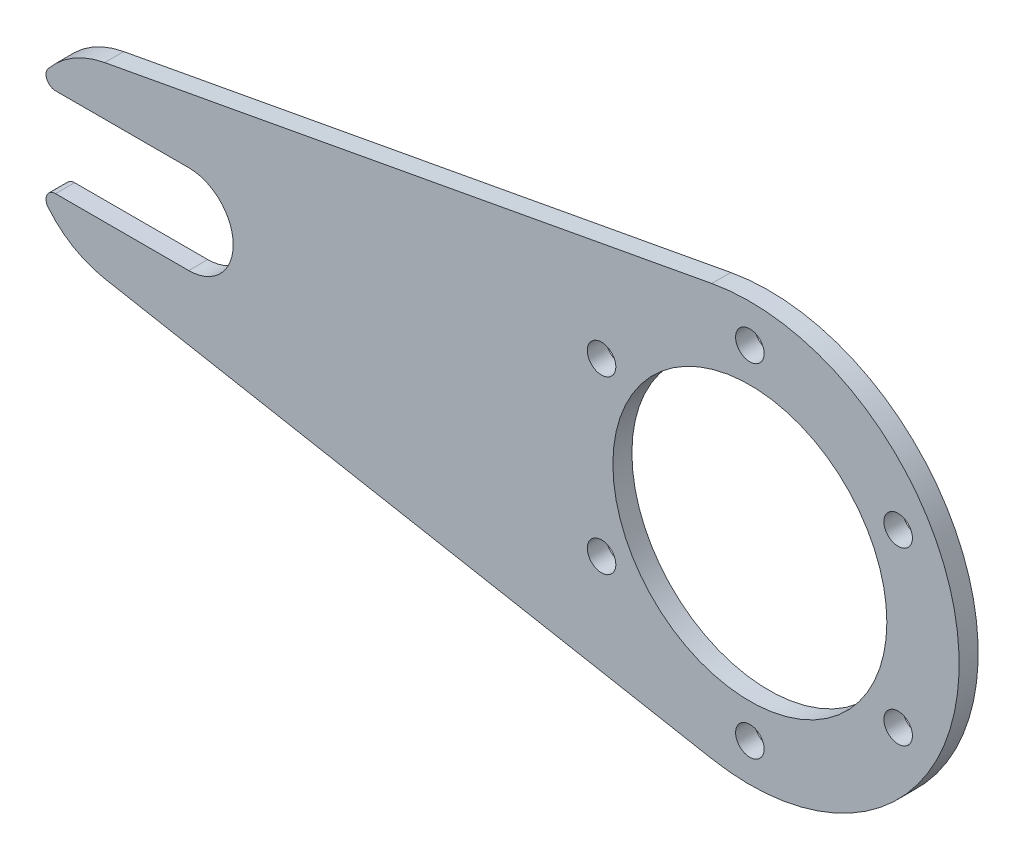
ISO-10303-21;
HEADER;
FILE_DESCRIPTION(('STEP AP214'),'2;1');
FILE_NAME('part.step','',(''),(''),'','','');
FILE_SCHEMA(('AUTOMOTIVE_DESIGN { 1 0 10303 214 1 1 1 1 }'));
ENDSEC;
DATA;
#1=APPLICATION_CONTEXT('core data for automotive mechanical design processes');
#2=APPLICATION_PROTOCOL_DEFINITION('international standard','automotive_design',2000,#1);
#3=PRODUCT_CONTEXT('',#1,'mechanical');
#4=PRODUCT('Part','Part','',(#3));
#5=PRODUCT_RELATED_PRODUCT_CATEGORY('part','',(#4));
#6=PRODUCT_DEFINITION_FORMATION('','',#4);
#7=PRODUCT_DEFINITION_CONTEXT('part definition',#1,'design');
#8=PRODUCT_DEFINITION('design','',#6,#7);
#9=PRODUCT_DEFINITION_SHAPE('','',#8);
#10=(LENGTH_UNIT() NAMED_UNIT(*) SI_UNIT(.MILLI.,.METRE.));
#11=(NAMED_UNIT(*) PLANE_ANGLE_UNIT() SI_UNIT($,.RADIAN.));
#12=(NAMED_UNIT(*) SI_UNIT($,.STERADIAN.) SOLID_ANGLE_UNIT());
#13=UNCERTAINTY_MEASURE_WITH_UNIT(LENGTH_MEASURE(1.E-05),#10,'distance_accuracy_value','');
#14=(GEOMETRIC_REPRESENTATION_CONTEXT(3) GLOBAL_UNCERTAINTY_ASSIGNED_CONTEXT((#13)) GLOBAL_UNIT_ASSIGNED_CONTEXT((#10,
#11,#12)) REPRESENTATION_CONTEXT('',''));
#15=CARTESIAN_POINT('',(0.,0.,0.));
#16=DIRECTION('',(0.,0.,1.));
#17=DIRECTION('',(1.,0.,0.));
#18=AXIS2_PLACEMENT_3D('',#15,#16,#17);
#19=CARTESIAN_POINT('',(-209.55,0.,6.35));
#20=DIRECTION('',(0.,0.,1.));
#21=DIRECTION('',(1.,0.,0.));
#22=AXIS2_PLACEMENT_3D('',#19,#20,#21);
#23=PLANE('',#22);
#24=CARTESIAN_POINT('',(-49.4933518262809,-28.5749999999995,6.35));
#25=DIRECTION('',(0.,0.,1.));
#26=DIRECTION('',(1.,0.,0.));
#27=AXIS2_PLACEMENT_3D('',#24,#25,#26);
#28=CIRCLE('',#27,4.7625);
#29=CARTESIAN_POINT('',(-44.7308518262809,-28.5749999999995,6.35));
#30=VERTEX_POINT('',#29);
#31=EDGE_CURVE('E235',#30,#30,#28,.T.);
#32=ORIENTED_EDGE('',*,*,#31,.F.);
#33=EDGE_LOOP('',(#32));
#34=FACE_BOUND('',#33,.T.);
#35=CARTESIAN_POINT('',(49.4933518262806,-28.5750000000002,6.35));
#36=DIRECTION('',(0.,0.,1.));
#37=DIRECTION('',(1.,0.,0.));
#38=AXIS2_PLACEMENT_3D('',#35,#36,#37);
#39=CIRCLE('',#38,4.7625);
#40=CARTESIAN_POINT('',(54.2558518262806,-28.5750000000002,6.35));
#41=VERTEX_POINT('',#40);
#42=EDGE_CURVE('E223',#41,#41,#39,.T.);
#43=ORIENTED_EDGE('',*,*,#42,.F.);
#44=EDGE_LOOP('',(#43));
#45=FACE_BOUND('',#44,.T.);
#46=CARTESIAN_POINT('',(0.,0.,6.35));
#47=DIRECTION('',(0.,0.,1.));
#48=DIRECTION('',(1.,0.,0.));
#49=AXIS2_PLACEMENT_3D('',#46,#47,#48);
#50=CIRCLE('',#49,45.72);
#51=CARTESIAN_POINT('',(45.72,0.,6.35));
#52=VERTEX_POINT('',#51);
#53=EDGE_CURVE('E211',#52,#52,#50,.T.);
#54=ORIENTED_EDGE('',*,*,#53,.F.);
#55=EDGE_LOOP('',(#54));
#56=FACE_BOUND('',#55,.T.);
#57=CARTESIAN_POINT('',(-209.55,0.,6.35));
#58=DIRECTION('',(0.,0.,1.));
#59=DIRECTION('',(1.,0.,0.));
#60=AXIS2_PLACEMENT_3D('',#57,#58,#59);
#61=CIRCLE('',#60,31.75);
#62=CARTESIAN_POINT('',(-215.322727272727,31.2207962716314,6.35));
#63=VERTEX_POINT('',#62);
#64=CARTESIAN_POINT('',(-234.178235051022,20.0377777777778,6.35));
#65=VERTEX_POINT('',#64);
#66=EDGE_CURVE('E160',#63,#65,#61,.T.);
#67=ORIENTED_EDGE('',*,*,#66,.T.);
#68=CARTESIAN_POINT('',(-231.71541154592,18.034,6.35));
#69=DIRECTION('',(0.,0.,1.));
#70=DIRECTION('',(1.,0.,0.));
#71=AXIS2_PLACEMENT_3D('',#68,#69,#70);
#72=CIRCLE('',#71,3.17500000000001);
#73=CARTESIAN_POINT('',(-231.71541154592,14.859,6.35));
#74=VERTEX_POINT('',#73);
#75=EDGE_CURVE('E98',#65,#74,#72,.T.);
#76=ORIENTED_EDGE('',*,*,#75,.T.);
#77=DIRECTION('',(1.,0.,0.));
#78=VECTOR('',#77,1.);
#79=CARTESIAN_POINT('',(-231.71541154592,14.859,6.35));
#80=LINE('',#79,#78);
#81=CARTESIAN_POINT('',(-187.26541154592,14.859,6.35));
#82=VERTEX_POINT('',#81);
#83=EDGE_CURVE('E181',#74,#82,#80,.T.);
#84=ORIENTED_EDGE('',*,*,#83,.T.);
#85=CARTESIAN_POINT('',(-187.26541154592,0.,6.35));
#86=DIRECTION('',(0.,0.,-1.));
#87=DIRECTION('',(1.,0.,0.));
#88=AXIS2_PLACEMENT_3D('',#85,#86,#87);
#89=CIRCLE('',#88,14.859);
#90=CARTESIAN_POINT('',(-187.26541154592,-14.859,6.35));
#91=VERTEX_POINT('',#90);
#92=EDGE_CURVE('E200',#82,#91,#89,.T.);
#93=ORIENTED_EDGE('',*,*,#92,.T.);
#94=DIRECTION('',(-1.,0.,0.));
#95=VECTOR('',#94,1.);
#96=CARTESIAN_POINT('',(-231.71541154592,-14.859,6.35));
#97=LINE('',#96,#95);
#98=CARTESIAN_POINT('',(-231.71541154592,-14.859,6.35));
#99=VERTEX_POINT('',#98);
#100=EDGE_CURVE('E197',#91,#99,#97,.T.);
#101=ORIENTED_EDGE('',*,*,#100,.T.);
#102=CARTESIAN_POINT('',(-231.71541154592,-18.034,6.35));
#103=DIRECTION('',(0.,0.,1.));
#104=DIRECTION('',(-1.,0.,0.));
#105=AXIS2_PLACEMENT_3D('',#102,#103,#104);
#106=CIRCLE('',#105,3.17500000000001);
#107=CARTESIAN_POINT('',(-234.178235051022,-20.0377777777778,6.35));
#108=VERTEX_POINT('',#107);
#109=EDGE_CURVE('E199',#99,#108,#106,.T.);
#110=ORIENTED_EDGE('',*,*,#109,.T.);
#111=CARTESIAN_POINT('',(-209.55,0.,6.35));
#112=DIRECTION('',(0.,0.,1.));
#113=DIRECTION('',(1.,0.,0.));
#114=AXIS2_PLACEMENT_3D('',#111,#112,#113);
#115=CIRCLE('',#114,31.75);
#116=CARTESIAN_POINT('',(-215.322727272727,-31.2207962716314,6.35));
#117=VERTEX_POINT('',#116);
#118=EDGE_CURVE('E123',#108,#117,#115,.T.);
#119=ORIENTED_EDGE('',*,*,#118,.T.);
#120=DIRECTION('',(0.983332166035633,-0.181818181818182,0.));
#121=VECTOR('',#120,1.);
#122=CARTESIAN_POINT('',(-215.322727272727,-31.2207962716314,6.35));
#123=LINE('',#122,#121);
#124=CARTESIAN_POINT('',(-12.7,-68.685751797589,6.35));
#125=VERTEX_POINT('',#124);
#126=EDGE_CURVE('E117',#117,#125,#123,.T.);
#127=ORIENTED_EDGE('',*,*,#126,.T.);
#128=CARTESIAN_POINT('',(0.,0.,6.35));
#129=DIRECTION('',(0.,0.,1.));
#130=DIRECTION('',(1.,0.,0.));
#131=AXIS2_PLACEMENT_3D('',#128,#129,#130);
#132=CIRCLE('',#131,69.85);
#133=CARTESIAN_POINT('',(-12.7,68.685751797589,6.35));
#134=VERTEX_POINT('',#133);
#135=EDGE_CURVE('E121',#125,#134,#132,.T.);
#136=ORIENTED_EDGE('',*,*,#135,.T.);
#137=DIRECTION('',(-0.983332166035633,-0.181818181818182,0.));
#138=VECTOR('',#137,1.);
#139=CARTESIAN_POINT('',(-215.322727272727,31.2207962716314,6.35));
#140=LINE('',#139,#138);
#141=EDGE_CURVE('E49',#134,#63,#140,.T.);
#142=ORIENTED_EDGE('',*,*,#141,.T.);
#143=EDGE_LOOP('',(#67,#76,#84,#93,#101,#110,#119,#127,#136,#142));
#144=FACE_BOUND('',#143,.T.);
#145=CARTESIAN_POINT('',(0.,57.15,6.35));
#146=DIRECTION('',(0.,0.,1.));
#147=DIRECTION('',(1.,0.,0.));
#148=AXIS2_PLACEMENT_3D('',#145,#146,#147);
#149=CIRCLE('',#148,4.7625);
#150=CARTESIAN_POINT('',(4.7625,57.15,6.35));
#151=VERTEX_POINT('',#150);
#152=EDGE_CURVE('E145',#151,#151,#149,.T.);
#153=ORIENTED_EDGE('',*,*,#152,.F.);
#154=EDGE_LOOP('',(#153));
#155=FACE_BOUND('',#154,.T.);
#156=CARTESIAN_POINT('',(49.4933518262807,28.5749999999999,6.35));
#157=DIRECTION('',(0.,0.,1.));
#158=DIRECTION('',(1.,0.,0.));
#159=AXIS2_PLACEMENT_3D('',#156,#157,#158);
#160=CIRCLE('',#159,4.7625);
#161=CARTESIAN_POINT('',(54.2558518262807,28.5749999999999,6.35));
#162=VERTEX_POINT('',#161);
#163=EDGE_CURVE('E217',#162,#162,#160,.T.);
#164=ORIENTED_EDGE('',*,*,#163,.F.);
#165=EDGE_LOOP('',(#164));
#166=FACE_BOUND('',#165,.T.);
#167=CARTESIAN_POINT('',(-3.9907631702977E-13,-57.15,6.35));
#168=DIRECTION('',(0.,0.,1.));
#169=DIRECTION('',(1.,0.,0.));
#170=AXIS2_PLACEMENT_3D('',#167,#168,#169);
#171=CIRCLE('',#170,4.7625);
#172=CARTESIAN_POINT('',(4.7624999999996,-57.15,6.35));
#173=VERTEX_POINT('',#172);
#174=EDGE_CURVE('E229',#173,#173,#171,.T.);
#175=ORIENTED_EDGE('',*,*,#174,.F.);
#176=EDGE_LOOP('',(#175));
#177=FACE_BOUND('',#176,.T.);
#178=CARTESIAN_POINT('',(-49.4933518262803,28.5750000000006,6.35));
#179=DIRECTION('',(0.,0.,1.));
#180=DIRECTION('',(1.,0.,0.));
#181=AXIS2_PLACEMENT_3D('',#178,#179,#180);
#182=CIRCLE('',#181,4.7625);
#183=CARTESIAN_POINT('',(-44.7308518262803,28.5750000000006,6.35));
#184=VERTEX_POINT('',#183);
#185=EDGE_CURVE('E241',#184,#184,#182,.T.);
#186=ORIENTED_EDGE('',*,*,#185,.F.);
#187=EDGE_LOOP('',(#186));
#188=FACE_BOUND('',#187,.T.);
#189=ADVANCED_FACE('F32',(#34,#45,#56,#144,#155,#166,#177,#188),#23,.T.);
#190=CARTESIAN_POINT('',(-209.55,0.,0.));
#191=DIRECTION('',(0.,0.,1.));
#192=DIRECTION('',(1.,0.,0.));
#193=AXIS2_PLACEMENT_3D('',#190,#191,#192);
#194=PLANE('',#193);
#195=CARTESIAN_POINT('',(-49.4933518262809,-28.5749999999995,0.));
#196=DIRECTION('',(0.,0.,1.));
#197=DIRECTION('',(1.,0.,0.));
#198=AXIS2_PLACEMENT_3D('',#195,#196,#197);
#199=CIRCLE('',#198,4.7625);
#200=CARTESIAN_POINT('',(-44.7308518262809,-28.5749999999995,0.));
#201=VERTEX_POINT('',#200);
#202=EDGE_CURVE('E238',#201,#201,#199,.T.);
#203=ORIENTED_EDGE('',*,*,#202,.T.);
#204=EDGE_LOOP('',(#203));
#205=FACE_BOUND('',#204,.T.);
#206=CARTESIAN_POINT('',(49.4933518262806,-28.5750000000002,0.));
#207=DIRECTION('',(0.,0.,1.));
#208=DIRECTION('',(1.,0.,0.));
#209=AXIS2_PLACEMENT_3D('',#206,#207,#208);
#210=CIRCLE('',#209,4.7625);
#211=CARTESIAN_POINT('',(54.2558518262806,-28.5750000000002,0.));
#212=VERTEX_POINT('',#211);
#213=EDGE_CURVE('E226',#212,#212,#210,.T.);
#214=ORIENTED_EDGE('',*,*,#213,.T.);
#215=EDGE_LOOP('',(#214));
#216=FACE_BOUND('',#215,.T.);
#217=CARTESIAN_POINT('',(0.,0.,0.));
#218=DIRECTION('',(0.,0.,1.));
#219=DIRECTION('',(1.,0.,0.));
#220=AXIS2_PLACEMENT_3D('',#217,#218,#219);
#221=CIRCLE('',#220,45.72);
#222=CARTESIAN_POINT('',(45.72,0.,0.));
#223=VERTEX_POINT('',#222);
#224=EDGE_CURVE('E214',#223,#223,#221,.T.);
#225=ORIENTED_EDGE('',*,*,#224,.T.);
#226=EDGE_LOOP('',(#225));
#227=FACE_BOUND('',#226,.T.);
#228=CARTESIAN_POINT('',(-209.55,0.,0.));
#229=DIRECTION('',(0.,0.,1.));
#230=DIRECTION('',(1.,0.,0.));
#231=AXIS2_PLACEMENT_3D('',#228,#229,#230);
#232=CIRCLE('',#231,31.75);
#233=CARTESIAN_POINT('',(-215.322727272727,31.2207962716314,0.));
#234=VERTEX_POINT('',#233);
#235=CARTESIAN_POINT('',(-234.178235051022,20.0377777777778,0.));
#236=VERTEX_POINT('',#235);
#237=EDGE_CURVE('E141',#234,#236,#232,.T.);
#238=ORIENTED_EDGE('',*,*,#237,.F.);
#239=DIRECTION('',(-0.983332166035633,-0.181818181818182,0.));
#240=VECTOR('',#239,1.);
#241=CARTESIAN_POINT('',(-215.322727272727,31.2207962716314,0.));
#242=LINE('',#241,#240);
#243=CARTESIAN_POINT('',(-12.7,68.685751797589,0.));
#244=VERTEX_POINT('',#243);
#245=EDGE_CURVE('E90',#244,#234,#242,.T.);
#246=ORIENTED_EDGE('',*,*,#245,.F.);
#247=CARTESIAN_POINT('',(0.,0.,0.));
#248=DIRECTION('',(0.,0.,1.));
#249=DIRECTION('',(1.,0.,0.));
#250=AXIS2_PLACEMENT_3D('',#247,#248,#249);
#251=CIRCLE('',#250,69.85);
#252=CARTESIAN_POINT('',(-12.7,-68.685751797589,0.));
#253=VERTEX_POINT('',#252);
#254=EDGE_CURVE('E84',#253,#244,#251,.T.);
#255=ORIENTED_EDGE('',*,*,#254,.F.);
#256=DIRECTION('',(0.983332166035633,-0.181818181818182,0.));
#257=VECTOR('',#256,1.);
#258=CARTESIAN_POINT('',(-215.322727272727,-31.2207962716314,0.));
#259=LINE('',#258,#257);
#260=CARTESIAN_POINT('',(-215.322727272727,-31.2207962716314,0.));
#261=VERTEX_POINT('',#260);
#262=EDGE_CURVE('E131',#261,#253,#259,.T.);
#263=ORIENTED_EDGE('',*,*,#262,.F.);
#264=CARTESIAN_POINT('',(-209.55,0.,0.));
#265=DIRECTION('',(0.,0.,1.));
#266=DIRECTION('',(1.,0.,0.));
#267=AXIS2_PLACEMENT_3D('',#264,#265,#266);
#268=CIRCLE('',#267,31.75);
#269=CARTESIAN_POINT('',(-234.178235051022,-20.0377777777778,0.));
#270=VERTEX_POINT('',#269);
#271=EDGE_CURVE('E155',#270,#261,#268,.T.);
#272=ORIENTED_EDGE('',*,*,#271,.F.);
#273=CARTESIAN_POINT('',(-231.71541154592,-18.034,0.));
#274=DIRECTION('',(0.,0.,1.));
#275=DIRECTION('',(-1.,0.,0.));
#276=AXIS2_PLACEMENT_3D('',#273,#274,#275);
#277=CIRCLE('',#276,3.17500000000001);
#278=CARTESIAN_POINT('',(-231.71541154592,-14.859,0.));
#279=VERTEX_POINT('',#278);
#280=EDGE_CURVE('E153',#279,#270,#277,.T.);
#281=ORIENTED_EDGE('',*,*,#280,.F.);
#282=DIRECTION('',(-1.,0.,0.));
#283=VECTOR('',#282,1.);
#284=CARTESIAN_POINT('',(-231.71541154592,-14.859,0.));
#285=LINE('',#284,#283);
#286=CARTESIAN_POINT('',(-187.26541154592,-14.859,0.));
#287=VERTEX_POINT('',#286);
#288=EDGE_CURVE('E151',#287,#279,#285,.T.);
#289=ORIENTED_EDGE('',*,*,#288,.F.);
#290=CARTESIAN_POINT('',(-187.26541154592,0.,0.));
#291=DIRECTION('',(0.,0.,-1.));
#292=DIRECTION('',(1.,0.,0.));
#293=AXIS2_PLACEMENT_3D('',#290,#291,#292);
#294=CIRCLE('',#293,14.859);
#295=CARTESIAN_POINT('',(-187.26541154592,14.859,0.));
#296=VERTEX_POINT('',#295);
#297=EDGE_CURVE('E149',#296,#287,#294,.T.);
#298=ORIENTED_EDGE('',*,*,#297,.F.);
#299=DIRECTION('',(1.,0.,0.));
#300=VECTOR('',#299,1.);
#301=CARTESIAN_POINT('',(-231.71541154592,14.859,0.));
#302=LINE('',#301,#300);
#303=CARTESIAN_POINT('',(-231.71541154592,14.859,0.));
#304=VERTEX_POINT('',#303);
#305=EDGE_CURVE('E147',#304,#296,#302,.T.);
#306=ORIENTED_EDGE('',*,*,#305,.F.);
#307=CARTESIAN_POINT('',(-231.71541154592,18.034,0.));
#308=DIRECTION('',(0.,0.,1.));
#309=DIRECTION('',(1.,0.,0.));
#310=AXIS2_PLACEMENT_3D('',#307,#308,#309);
#311=CIRCLE('',#310,3.17500000000001);
#312=EDGE_CURVE('E144',#236,#304,#311,.T.);
#313=ORIENTED_EDGE('',*,*,#312,.F.);
#314=EDGE_LOOP('',(#238,#246,#255,#263,#272,#281,#289,#298,#306,#313));
#315=FACE_BOUND('',#314,.T.);
#316=CARTESIAN_POINT('',(0.,57.15,0.));
#317=DIRECTION('',(0.,0.,1.));
#318=DIRECTION('',(1.,0.,0.));
#319=AXIS2_PLACEMENT_3D('',#316,#317,#318);
#320=CIRCLE('',#319,4.7625);
#321=CARTESIAN_POINT('',(4.7625,57.15,0.));
#322=VERTEX_POINT('',#321);
#323=EDGE_CURVE('E208',#322,#322,#320,.T.);
#324=ORIENTED_EDGE('',*,*,#323,.T.);
#325=EDGE_LOOP('',(#324));
#326=FACE_BOUND('',#325,.T.);
#327=CARTESIAN_POINT('',(49.4933518262807,28.5749999999999,0.));
#328=DIRECTION('',(0.,0.,1.));
#329=DIRECTION('',(1.,0.,0.));
#330=AXIS2_PLACEMENT_3D('',#327,#328,#329);
#331=CIRCLE('',#330,4.7625);
#332=CARTESIAN_POINT('',(54.2558518262807,28.5749999999999,0.));
#333=VERTEX_POINT('',#332);
#334=EDGE_CURVE('E220',#333,#333,#331,.T.);
#335=ORIENTED_EDGE('',*,*,#334,.T.);
#336=EDGE_LOOP('',(#335));
#337=FACE_BOUND('',#336,.T.);
#338=CARTESIAN_POINT('',(-3.9907631702977E-13,-57.15,0.));
#339=DIRECTION('',(0.,0.,1.));
#340=DIRECTION('',(1.,0.,0.));
#341=AXIS2_PLACEMENT_3D('',#338,#339,#340);
#342=CIRCLE('',#341,4.7625);
#343=CARTESIAN_POINT('',(4.7624999999996,-57.15,0.));
#344=VERTEX_POINT('',#343);
#345=EDGE_CURVE('E232',#344,#344,#342,.T.);
#346=ORIENTED_EDGE('',*,*,#345,.T.);
#347=EDGE_LOOP('',(#346));
#348=FACE_BOUND('',#347,.T.);
#349=CARTESIAN_POINT('',(-49.4933518262803,28.5750000000006,0.));
#350=DIRECTION('',(0.,0.,1.));
#351=DIRECTION('',(1.,0.,0.));
#352=AXIS2_PLACEMENT_3D('',#349,#350,#351);
#353=CIRCLE('',#352,4.7625);
#354=CARTESIAN_POINT('',(-44.7308518262803,28.5750000000006,0.));
#355=VERTEX_POINT('',#354);
#356=EDGE_CURVE('E244',#355,#355,#353,.T.);
#357=ORIENTED_EDGE('',*,*,#356,.T.);
#358=EDGE_LOOP('',(#357));
#359=FACE_BOUND('',#358,.T.);
#360=ADVANCED_FACE('F185',(#205,#216,#227,#315,#326,#337,#348,#359),#194,.F.);
#361=CARTESIAN_POINT('',(-209.55,0.,6.35));
#362=DIRECTION('',(0.,0.,-1.));
#363=DIRECTION('',(-1.,0.,0.));
#364=AXIS2_PLACEMENT_3D('',#361,#362,#363);
#365=CYLINDRICAL_SURFACE('',#364,31.75);
#366=ORIENTED_EDGE('',*,*,#237,.T.);
#367=DIRECTION('',(0.,0.,-1.));
#368=VECTOR('',#367,1.);
#369=CARTESIAN_POINT('',(-234.178235051022,20.0377777777778,6.35));
#370=LINE('',#369,#368);
#371=EDGE_CURVE('E11',#65,#236,#370,.T.);
#372=ORIENTED_EDGE('',*,*,#371,.F.);
#373=ORIENTED_EDGE('',*,*,#66,.F.);
#374=DIRECTION('',(0.,0.,-1.));
#375=VECTOR('',#374,1.);
#376=CARTESIAN_POINT('',(-215.322727272727,31.2207962716314,6.35));
#377=LINE('',#376,#375);
#378=EDGE_CURVE('E137',#63,#234,#377,.T.);
#379=ORIENTED_EDGE('',*,*,#378,.T.);
#380=EDGE_LOOP('',(#366,#372,#373,#379));
#381=FACE_BOUND('',#380,.T.);
#382=ADVANCED_FACE('F34',(#381),#365,.T.);
#383=CARTESIAN_POINT('',(-231.71541154592,18.034,6.35));
#384=DIRECTION('',(0.,0.,-1.));
#385=DIRECTION('',(-1.,0.,0.));
#386=AXIS2_PLACEMENT_3D('',#383,#384,#385);
#387=CYLINDRICAL_SURFACE('',#386,3.17500000000001);
#388=ORIENTED_EDGE('',*,*,#312,.T.);
#389=DIRECTION('',(0.,0.,-1.));
#390=VECTOR('',#389,1.);
#391=CARTESIAN_POINT('',(-231.71541154592,14.859,6.35));
#392=LINE('',#391,#390);
#393=EDGE_CURVE('E41',#74,#304,#392,.T.);
#394=ORIENTED_EDGE('',*,*,#393,.F.);
#395=ORIENTED_EDGE('',*,*,#75,.F.);
#396=ORIENTED_EDGE('',*,*,#371,.T.);
#397=EDGE_LOOP('',(#388,#394,#395,#396));
#398=FACE_BOUND('',#397,.T.);
#399=ADVANCED_FACE('F287',(#398),#387,.T.);
#400=CARTESIAN_POINT('',(-231.71541154592,14.859,6.35));
#401=DIRECTION('',(0.,1.,0.));
#402=DIRECTION('',(0.,0.,1.));
#403=AXIS2_PLACEMENT_3D('',#400,#401,#402);
#404=PLANE('',#403);
#405=ORIENTED_EDGE('',*,*,#305,.T.);
#406=DIRECTION('',(0.,0.,-1.));
#407=VECTOR('',#406,1.);
#408=CARTESIAN_POINT('',(-187.26541154592,14.859,6.35));
#409=LINE('',#408,#407);
#410=EDGE_CURVE('E173',#82,#296,#409,.T.);
#411=ORIENTED_EDGE('',*,*,#410,.F.);
#412=ORIENTED_EDGE('',*,*,#83,.F.);
#413=ORIENTED_EDGE('',*,*,#393,.T.);
#414=EDGE_LOOP('',(#405,#411,#412,#413));
#415=FACE_BOUND('',#414,.T.);
#416=ADVANCED_FACE('F179',(#415),#404,.F.);
#417=CARTESIAN_POINT('',(-187.26541154592,0.,6.35));
#418=DIRECTION('',(0.,0.,-1.));
#419=DIRECTION('',(-1.,0.,0.));
#420=AXIS2_PLACEMENT_3D('',#417,#418,#419);
#421=CYLINDRICAL_SURFACE('',#420,14.859);
#422=ORIENTED_EDGE('',*,*,#297,.T.);
#423=DIRECTION('',(0.,0.,-1.));
#424=VECTOR('',#423,1.);
#425=CARTESIAN_POINT('',(-187.26541154592,-14.859,6.35));
#426=LINE('',#425,#424);
#427=EDGE_CURVE('E170',#91,#287,#426,.T.);
#428=ORIENTED_EDGE('',*,*,#427,.F.);
#429=ORIENTED_EDGE('',*,*,#92,.F.);
#430=ORIENTED_EDGE('',*,*,#410,.T.);
#431=EDGE_LOOP('',(#422,#428,#429,#430));
#432=FACE_BOUND('',#431,.T.);
#433=ADVANCED_FACE('F191',(#432),#421,.F.);
#434=CARTESIAN_POINT('',(-231.71541154592,-14.859,6.35));
#435=DIRECTION('',(0.,-1.,0.));
#436=DIRECTION('',(1.,0.,0.));
#437=AXIS2_PLACEMENT_3D('',#434,#435,#436);
#438=PLANE('',#437);
#439=ORIENTED_EDGE('',*,*,#288,.T.);
#440=DIRECTION('',(0.,0.,-1.));
#441=VECTOR('',#440,1.);
#442=CARTESIAN_POINT('',(-231.71541154592,-14.859,6.35));
#443=LINE('',#442,#441);
#444=EDGE_CURVE('E167',#99,#279,#443,.T.);
#445=ORIENTED_EDGE('',*,*,#444,.F.);
#446=ORIENTED_EDGE('',*,*,#100,.F.);
#447=ORIENTED_EDGE('',*,*,#427,.T.);
#448=EDGE_LOOP('',(#439,#445,#446,#447));
#449=FACE_BOUND('',#448,.T.);
#450=ADVANCED_FACE('F195',(#449),#438,.F.);
#451=CARTESIAN_POINT('',(-231.71541154592,-18.034,6.35));
#452=DIRECTION('',(0.,0.,-1.));
#453=DIRECTION('',(-1.,0.,0.));
#454=AXIS2_PLACEMENT_3D('',#451,#452,#453);
#455=CYLINDRICAL_SURFACE('',#454,3.17500000000001);
#456=ORIENTED_EDGE('',*,*,#280,.T.);
#457=DIRECTION('',(0.,0.,-1.));
#458=VECTOR('',#457,1.);
#459=CARTESIAN_POINT('',(-234.178235051022,-20.0377777777778,6.35));
#460=LINE('',#459,#458);
#461=EDGE_CURVE('E164',#108,#270,#460,.T.);
#462=ORIENTED_EDGE('',*,*,#461,.F.);
#463=ORIENTED_EDGE('',*,*,#109,.F.);
#464=ORIENTED_EDGE('',*,*,#444,.T.);
#465=EDGE_LOOP('',(#456,#462,#463,#464));
#466=FACE_BOUND('',#465,.T.);
#467=ADVANCED_FACE('F277',(#466),#455,.T.);
#468=CARTESIAN_POINT('',(-209.55,0.,6.35));
#469=DIRECTION('',(0.,0.,-1.));
#470=DIRECTION('',(-1.,0.,0.));
#471=AXIS2_PLACEMENT_3D('',#468,#469,#470);
#472=CYLINDRICAL_SURFACE('',#471,31.75);
#473=ORIENTED_EDGE('',*,*,#271,.T.);
#474=DIRECTION('',(0.,0.,-1.));
#475=VECTOR('',#474,1.);
#476=CARTESIAN_POINT('',(-215.322727272727,-31.2207962716314,6.35));
#477=LINE('',#476,#475);
#478=EDGE_CURVE('E132',#117,#261,#477,.T.);
#479=ORIENTED_EDGE('',*,*,#478,.F.);
#480=ORIENTED_EDGE('',*,*,#118,.F.);
#481=ORIENTED_EDGE('',*,*,#461,.T.);
#482=EDGE_LOOP('',(#473,#479,#480,#481));
#483=FACE_BOUND('',#482,.T.);
#484=ADVANCED_FACE('F274',(#483),#472,.T.);
#485=CARTESIAN_POINT('',(-215.322727272727,-31.2207962716314,6.35));
#486=DIRECTION('',(0.181818181818182,0.983332166035633,0.));
#487=DIRECTION('',(-0.983332166035634,0.181818181818182,0.));
#488=AXIS2_PLACEMENT_3D('',#485,#486,#487);
#489=PLANE('',#488);
#490=ORIENTED_EDGE('',*,*,#262,.T.);
#491=DIRECTION('',(0.,0.,-1.));
#492=VECTOR('',#491,1.);
#493=CARTESIAN_POINT('',(-12.7,-68.685751797589,6.35));
#494=LINE('',#493,#492);
#495=EDGE_CURVE('E128',#125,#253,#494,.T.);
#496=ORIENTED_EDGE('',*,*,#495,.F.);
#497=ORIENTED_EDGE('',*,*,#126,.F.);
#498=ORIENTED_EDGE('',*,*,#478,.T.);
#499=EDGE_LOOP('',(#490,#496,#497,#498));
#500=FACE_BOUND('',#499,.T.);
#501=ADVANCED_FACE('F129',(#500),#489,.F.);
#502=CARTESIAN_POINT('',(0.,0.,6.35));
#503=DIRECTION('',(0.,0.,-1.));
#504=DIRECTION('',(-1.,0.,0.));
#505=AXIS2_PLACEMENT_3D('',#502,#503,#504);
#506=CYLINDRICAL_SURFACE('',#505,69.85);
#507=ORIENTED_EDGE('',*,*,#254,.T.);
#508=DIRECTION('',(0.,0.,-1.));
#509=VECTOR('',#508,1.);
#510=CARTESIAN_POINT('',(-12.7,68.685751797589,6.35));
#511=LINE('',#510,#509);
#512=EDGE_CURVE('E133',#134,#244,#511,.T.);
#513=ORIENTED_EDGE('',*,*,#512,.F.);
#514=ORIENTED_EDGE('',*,*,#135,.F.);
#515=ORIENTED_EDGE('',*,*,#495,.T.);
#516=EDGE_LOOP('',(#507,#513,#514,#515));
#517=FACE_BOUND('',#516,.T.);
#518=ADVANCED_FACE('F135',(#517),#506,.T.);
#519=CARTESIAN_POINT('',(-215.322727272727,31.2207962716314,6.35));
#520=DIRECTION('',(0.181818181818182,-0.983332166035633,0.));
#521=DIRECTION('',(0.983332166035634,0.181818181818182,0.));
#522=AXIS2_PLACEMENT_3D('',#519,#520,#521);
#523=PLANE('',#522);
#524=ORIENTED_EDGE('',*,*,#245,.T.);
#525=ORIENTED_EDGE('',*,*,#378,.F.);
#526=ORIENTED_EDGE('',*,*,#141,.F.);
#527=ORIENTED_EDGE('',*,*,#512,.T.);
#528=EDGE_LOOP('',(#524,#525,#526,#527));
#529=FACE_BOUND('',#528,.T.);
#530=ADVANCED_FACE('F267',(#529),#523,.F.);
#531=CARTESIAN_POINT('',(0.,57.15,6.35));
#532=DIRECTION('',(0.,0.,-1.));
#533=DIRECTION('',(-1.,0.,0.));
#534=AXIS2_PLACEMENT_3D('',#531,#532,#533);
#535=CYLINDRICAL_SURFACE('',#534,4.7625);
#536=ORIENTED_EDGE('',*,*,#152,.T.);
#537=EDGE_LOOP('',(#536));
#538=FACE_BOUND('',#537,.T.);
#539=ORIENTED_EDGE('',*,*,#323,.F.);
#540=EDGE_LOOP('',(#539));
#541=FACE_BOUND('',#540,.T.);
#542=ADVANCED_FACE('F264',(#538,#541),#535,.F.);
#543=CARTESIAN_POINT('',(0.,0.,6.35));
#544=DIRECTION('',(0.,0.,-1.));
#545=DIRECTION('',(-1.,0.,0.));
#546=AXIS2_PLACEMENT_3D('',#543,#544,#545);
#547=CYLINDRICAL_SURFACE('',#546,45.72);
#548=ORIENTED_EDGE('',*,*,#53,.T.);
#549=EDGE_LOOP('',(#548));
#550=FACE_BOUND('',#549,.T.);
#551=ORIENTED_EDGE('',*,*,#224,.F.);
#552=EDGE_LOOP('',(#551));
#553=FACE_BOUND('',#552,.T.);
#554=ADVANCED_FACE('F363',(#550,#553),#547,.F.);
#555=CARTESIAN_POINT('',(49.4933518262807,28.5749999999999,6.35));
#556=DIRECTION('',(0.,0.,-1.));
#557=DIRECTION('',(-1.,0.,0.));
#558=AXIS2_PLACEMENT_3D('',#555,#556,#557);
#559=CYLINDRICAL_SURFACE('',#558,4.7625);
#560=ORIENTED_EDGE('',*,*,#163,.T.);
#561=EDGE_LOOP('',(#560));
#562=FACE_BOUND('',#561,.T.);
#563=ORIENTED_EDGE('',*,*,#334,.F.);
#564=EDGE_LOOP('',(#563));
#565=FACE_BOUND('',#564,.T.);
#566=ADVANCED_FACE('F371',(#562,#565),#559,.F.);
#567=CARTESIAN_POINT('',(49.4933518262806,-28.5750000000002,6.35));
#568=DIRECTION('',(0.,0.,-1.));
#569=DIRECTION('',(-1.,0.,0.));
#570=AXIS2_PLACEMENT_3D('',#567,#568,#569);
#571=CYLINDRICAL_SURFACE('',#570,4.7625);
#572=ORIENTED_EDGE('',*,*,#42,.T.);
#573=EDGE_LOOP('',(#572));
#574=FACE_BOUND('',#573,.T.);
#575=ORIENTED_EDGE('',*,*,#213,.F.);
#576=EDGE_LOOP('',(#575));
#577=FACE_BOUND('',#576,.T.);
#578=ADVANCED_FACE('F379',(#574,#577),#571,.F.);
#579=CARTESIAN_POINT('',(-3.9907631702977E-13,-57.15,6.35));
#580=DIRECTION('',(0.,0.,-1.));
#581=DIRECTION('',(-1.,0.,0.));
#582=AXIS2_PLACEMENT_3D('',#579,#580,#581);
#583=CYLINDRICAL_SURFACE('',#582,4.7625);
#584=ORIENTED_EDGE('',*,*,#174,.T.);
#585=EDGE_LOOP('',(#584));
#586=FACE_BOUND('',#585,.T.);
#587=ORIENTED_EDGE('',*,*,#345,.F.);
#588=EDGE_LOOP('',(#587));
#589=FACE_BOUND('',#588,.T.);
#590=ADVANCED_FACE('F388',(#586,#589),#583,.F.);
#591=CARTESIAN_POINT('',(-49.4933518262809,-28.5749999999995,6.35));
#592=DIRECTION('',(0.,0.,-1.));
#593=DIRECTION('',(-1.,0.,0.));
#594=AXIS2_PLACEMENT_3D('',#591,#592,#593);
#595=CYLINDRICAL_SURFACE('',#594,4.7625);
#596=ORIENTED_EDGE('',*,*,#31,.T.);
#597=EDGE_LOOP('',(#596));
#598=FACE_BOUND('',#597,.T.);
#599=ORIENTED_EDGE('',*,*,#202,.F.);
#600=EDGE_LOOP('',(#599));
#601=FACE_BOUND('',#600,.T.);
#602=ADVANCED_FACE('F397',(#598,#601),#595,.F.);
#603=CARTESIAN_POINT('',(-49.4933518262803,28.5750000000006,6.35));
#604=DIRECTION('',(0.,0.,-1.));
#605=DIRECTION('',(-1.,0.,0.));
#606=AXIS2_PLACEMENT_3D('',#603,#604,#605);
#607=CYLINDRICAL_SURFACE('',#606,4.7625);
#608=ORIENTED_EDGE('',*,*,#185,.T.);
#609=EDGE_LOOP('',(#608));
#610=FACE_BOUND('',#609,.T.);
#611=ORIENTED_EDGE('',*,*,#356,.F.);
#612=EDGE_LOOP('',(#611));
#613=FACE_BOUND('',#612,.T.);
#614=ADVANCED_FACE('F250',(#610,#613),#607,.F.);
#615=CLOSED_SHELL('',(#189,#360,#382,#399,#416,#433,#450,#467,#484,#501,#518,#530,#542,#554,
#566,#578,#590,#602,#614));
#616=MANIFOLD_SOLID_BREP('B2',#615);
#617=ADVANCED_BREP_SHAPE_REPRESENTATION('',(#18,#616),#14);
#618=SHAPE_DEFINITION_REPRESENTATION(#9,#617);
ENDSEC;
END-ISO-10303-21;
